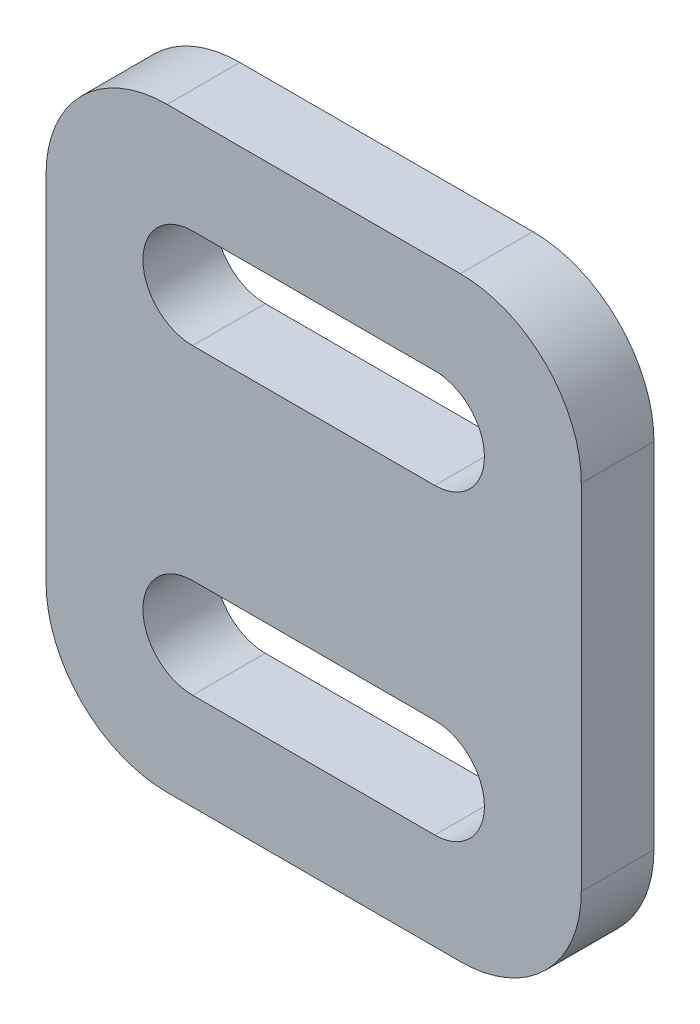
ISO-10303-21;
HEADER;
FILE_DESCRIPTION(('STEP AP214'),'2;1');
FILE_NAME('part.step','',(''),(''),'','','');
FILE_SCHEMA(('AUTOMOTIVE_DESIGN { 1 0 10303 214 1 1 1 1 }'));
ENDSEC;
DATA;
#1=APPLICATION_CONTEXT('core data for automotive mechanical design processes');
#2=APPLICATION_PROTOCOL_DEFINITION('international standard','automotive_design',2000,#1);
#3=PRODUCT_CONTEXT('',#1,'mechanical');
#4=PRODUCT('Part','Part','',(#3));
#5=PRODUCT_RELATED_PRODUCT_CATEGORY('part','',(#4));
#6=PRODUCT_DEFINITION_FORMATION('','',#4);
#7=PRODUCT_DEFINITION_CONTEXT('part definition',#1,'design');
#8=PRODUCT_DEFINITION('design','',#6,#7);
#9=PRODUCT_DEFINITION_SHAPE('','',#8);
#10=(LENGTH_UNIT() NAMED_UNIT(*) SI_UNIT(.MILLI.,.METRE.));
#11=(NAMED_UNIT(*) PLANE_ANGLE_UNIT() SI_UNIT($,.RADIAN.));
#12=(NAMED_UNIT(*) SI_UNIT($,.STERADIAN.) SOLID_ANGLE_UNIT());
#13=UNCERTAINTY_MEASURE_WITH_UNIT(LENGTH_MEASURE(1.E-05),#10,'distance_accuracy_value','');
#14=(GEOMETRIC_REPRESENTATION_CONTEXT(3) GLOBAL_UNCERTAINTY_ASSIGNED_CONTEXT((#13)) GLOBAL_UNIT_ASSIGNED_CONTEXT((#10,
#11,#12)) REPRESENTATION_CONTEXT('',''));
#15=CARTESIAN_POINT('',(0.,0.,0.));
#16=DIRECTION('',(0.,0.,1.));
#17=DIRECTION('',(1.,0.,0.));
#18=AXIS2_PLACEMENT_3D('',#15,#16,#17);
#19=CARTESIAN_POINT('',(16.0718820900679,0.,3.));
#20=DIRECTION('',(-1.,0.,0.));
#21=DIRECTION('',(0.,-1.,0.));
#22=AXIS2_PLACEMENT_3D('',#19,#20,#21);
#23=PLANE('',#22);
#24=DIRECTION('',(0.,1.,0.));
#25=VECTOR('',#24,1.);
#26=CARTESIAN_POINT('',(16.0718820900679,0.,3.));
#27=LINE('',#26,#25);
#28=CARTESIAN_POINT('',(16.0718820900679,12.95,3.));
#29=VERTEX_POINT('',#28);
#30=CARTESIAN_POINT('',(16.0718820900679,27.55,3.));
#31=VERTEX_POINT('',#30);
#32=EDGE_CURVE('E192',#29,#31,#27,.T.);
#33=ORIENTED_EDGE('',*,*,#32,.T.);
#34=DIRECTION('',(0.,0.,-1.));
#35=VECTOR('',#34,1.);
#36=CARTESIAN_POINT('',(16.0718820900679,27.55,0.));
#37=LINE('',#36,#35);
#38=CARTESIAN_POINT('',(16.0718820900679,27.55,0.));
#39=VERTEX_POINT('',#38);
#40=EDGE_CURVE('E248',#31,#39,#37,.T.);
#41=ORIENTED_EDGE('',*,*,#40,.T.);
#42=DIRECTION('',(0.,1.,0.));
#43=VECTOR('',#42,1.);
#44=CARTESIAN_POINT('',(16.0718820900679,0.,0.));
#45=LINE('',#44,#43);
#46=CARTESIAN_POINT('',(16.0718820900679,12.95,0.));
#47=VERTEX_POINT('',#46);
#48=EDGE_CURVE('E225',#47,#39,#45,.T.);
#49=ORIENTED_EDGE('',*,*,#48,.F.);
#50=DIRECTION('',(0.,0.,-1.));
#51=VECTOR('',#50,1.);
#52=CARTESIAN_POINT('',(16.0718820900679,12.95,3.));
#53=LINE('',#52,#51);
#54=EDGE_CURVE('E242',#47,#29,#53,.F.);
#55=ORIENTED_EDGE('',*,*,#54,.T.);
#56=EDGE_LOOP('',(#33,#41,#49,#55));
#57=FACE_BOUND('',#56,.T.);
#58=ADVANCED_FACE('F36',(#57),#23,.T.);
#59=CARTESIAN_POINT('',(0.,7.95,3.));
#60=DIRECTION('',(0.,-1.,0.));
#61=DIRECTION('',(1.,0.,0.));
#62=AXIS2_PLACEMENT_3D('',#59,#60,#61);
#63=PLANE('',#62);
#64=DIRECTION('',(-1.,0.,0.));
#65=VECTOR('',#64,1.);
#66=CARTESIAN_POINT('',(0.,7.95,3.));
#67=LINE('',#66,#65);
#68=CARTESIAN_POINT('',(33.1718820900679,7.94999999999999,3.));
#69=VERTEX_POINT('',#68);
#70=CARTESIAN_POINT('',(21.0718820900679,7.94999999999999,3.));
#71=VERTEX_POINT('',#70);
#72=EDGE_CURVE('E195',#69,#71,#67,.T.);
#73=ORIENTED_EDGE('',*,*,#72,.T.);
#74=DIRECTION('',(0.,0.,-1.));
#75=VECTOR('',#74,1.);
#76=CARTESIAN_POINT('',(21.0718820900679,7.94999999999999,3.));
#77=LINE('',#76,#75);
#78=CARTESIAN_POINT('',(21.0718820900679,7.94999999999999,0.));
#79=VERTEX_POINT('',#78);
#80=EDGE_CURVE('E273',#71,#79,#77,.T.);
#81=ORIENTED_EDGE('',*,*,#80,.T.);
#82=DIRECTION('',(-1.,0.,0.));
#83=VECTOR('',#82,1.);
#84=CARTESIAN_POINT('',(0.,7.95,0.));
#85=LINE('',#84,#83);
#86=CARTESIAN_POINT('',(33.1718820900679,7.94999999999999,0.));
#87=VERTEX_POINT('',#86);
#88=EDGE_CURVE('E228',#87,#79,#85,.T.);
#89=ORIENTED_EDGE('',*,*,#88,.F.);
#90=DIRECTION('',(0.,0.,-1.));
#91=VECTOR('',#90,1.);
#92=CARTESIAN_POINT('',(33.1718820900679,7.94999999999999,3.));
#93=LINE('',#92,#91);
#94=EDGE_CURVE('E271',#87,#69,#93,.F.);
#95=ORIENTED_EDGE('',*,*,#94,.T.);
#96=EDGE_LOOP('',(#73,#81,#89,#95));
#97=FACE_BOUND('',#96,.T.);
#98=ADVANCED_FACE('F278',(#97),#63,.T.);
#99=CARTESIAN_POINT('',(38.1718820900679,0.,3.));
#100=DIRECTION('',(-1.,0.,0.));
#101=DIRECTION('',(0.,0.,1.));
#102=AXIS2_PLACEMENT_3D('',#99,#100,#101);
#103=PLANE('',#102);
#104=DIRECTION('',(0.,1.,0.));
#105=VECTOR('',#104,1.);
#106=CARTESIAN_POINT('',(38.1718820900679,0.,3.));
#107=LINE('',#106,#105);
#108=CARTESIAN_POINT('',(38.1718820900679,12.95,3.));
#109=VERTEX_POINT('',#108);
#110=CARTESIAN_POINT('',(38.1718820900679,27.55,3.));
#111=VERTEX_POINT('',#110);
#112=EDGE_CURVE('E198',#109,#111,#107,.T.);
#113=ORIENTED_EDGE('',*,*,#112,.F.);
#114=DIRECTION('',(0.,0.,-1.));
#115=VECTOR('',#114,1.);
#116=CARTESIAN_POINT('',(38.1718820900679,12.95,0.));
#117=LINE('',#116,#115);
#118=CARTESIAN_POINT('',(38.1718820900679,12.95,0.));
#119=VERTEX_POINT('',#118);
#120=EDGE_CURVE('E11',#109,#119,#117,.T.);
#121=ORIENTED_EDGE('',*,*,#120,.T.);
#122=DIRECTION('',(0.,1.,0.));
#123=VECTOR('',#122,1.);
#124=CARTESIAN_POINT('',(38.1718820900679,0.,0.));
#125=LINE('',#124,#123);
#126=CARTESIAN_POINT('',(38.1718820900679,27.55,0.));
#127=VERTEX_POINT('',#126);
#128=EDGE_CURVE('E231',#119,#127,#125,.T.);
#129=ORIENTED_EDGE('',*,*,#128,.T.);
#130=DIRECTION('',(0.,0.,-1.));
#131=VECTOR('',#130,1.);
#132=CARTESIAN_POINT('',(38.1718820900679,27.55,3.));
#133=LINE('',#132,#131);
#134=EDGE_CURVE('E44',#127,#111,#133,.F.);
#135=ORIENTED_EDGE('',*,*,#134,.T.);
#136=EDGE_LOOP('',(#113,#121,#129,#135));
#137=FACE_BOUND('',#136,.T.);
#138=ADVANCED_FACE('F289',(#137),#103,.F.);
#139=CARTESIAN_POINT('',(32.1218820900679,26.5,3.));
#140=DIRECTION('',(0.,0.,-1.));
#141=DIRECTION('',(-1.,0.,0.));
#142=AXIS2_PLACEMENT_3D('',#139,#140,#141);
#143=CYLINDRICAL_SURFACE('',#142,2.05000000000001);
#144=CARTESIAN_POINT('',(32.1218820900679,26.5,0.));
#145=DIRECTION('',(0.,0.,1.));
#146=DIRECTION('',(1.,0.,0.));
#147=AXIS2_PLACEMENT_3D('',#144,#145,#146);
#148=CIRCLE('',#147,2.05000000000001);
#149=CARTESIAN_POINT('',(32.1218820900679,24.45,0.));
#150=VERTEX_POINT('',#149);
#151=CARTESIAN_POINT('',(32.1218820900679,28.55,0.));
#152=VERTEX_POINT('',#151);
#153=EDGE_CURVE('E213',#150,#152,#148,.T.);
#154=ORIENTED_EDGE('',*,*,#153,.F.);
#155=DIRECTION('',(0.,0.,-1.));
#156=VECTOR('',#155,1.);
#157=CARTESIAN_POINT('',(32.1218820900679,24.45,3.));
#158=LINE('',#157,#156);
#159=CARTESIAN_POINT('',(32.1218820900679,24.45,3.));
#160=VERTEX_POINT('',#159);
#161=EDGE_CURVE('E240',#160,#150,#158,.T.);
#162=ORIENTED_EDGE('',*,*,#161,.F.);
#163=CARTESIAN_POINT('',(32.1218820900679,26.5,3.));
#164=DIRECTION('',(0.,0.,1.));
#165=DIRECTION('',(1.,0.,0.));
#166=AXIS2_PLACEMENT_3D('',#163,#164,#165);
#167=CIRCLE('',#166,2.05000000000001);
#168=CARTESIAN_POINT('',(32.1218820900679,28.55,3.));
#169=VERTEX_POINT('',#168);
#170=EDGE_CURVE('E181',#160,#169,#167,.T.);
#171=ORIENTED_EDGE('',*,*,#170,.T.);
#172=DIRECTION('',(0.,0.,-1.));
#173=VECTOR('',#172,1.);
#174=CARTESIAN_POINT('',(32.1218820900679,28.55,3.));
#175=LINE('',#174,#173);
#176=EDGE_CURVE('E160',#169,#152,#175,.T.);
#177=ORIENTED_EDGE('',*,*,#176,.T.);
#178=EDGE_LOOP('',(#154,#162,#171,#177));
#179=FACE_BOUND('',#178,.T.);
#180=ADVANCED_FACE('F334',(#179),#143,.F.);
#181=CARTESIAN_POINT('',(0.,24.45,3.));
#182=DIRECTION('',(0.,1.,0.));
#183=DIRECTION('',(0.,0.,1.));
#184=AXIS2_PLACEMENT_3D('',#181,#182,#183);
#185=PLANE('',#184);
#186=DIRECTION('',(1.,0.,0.));
#187=VECTOR('',#186,1.);
#188=CARTESIAN_POINT('',(0.,24.45,0.));
#189=LINE('',#188,#187);
#190=CARTESIAN_POINT('',(22.1218820900679,24.45,0.));
#191=VERTEX_POINT('',#190);
#192=EDGE_CURVE('E216',#191,#150,#189,.T.);
#193=ORIENTED_EDGE('',*,*,#192,.F.);
#194=DIRECTION('',(0.,0.,-1.));
#195=VECTOR('',#194,1.);
#196=CARTESIAN_POINT('',(22.1218820900679,24.45,3.));
#197=LINE('',#196,#195);
#198=CARTESIAN_POINT('',(22.1218820900679,24.45,3.));
#199=VERTEX_POINT('',#198);
#200=EDGE_CURVE('E238',#199,#191,#197,.T.);
#201=ORIENTED_EDGE('',*,*,#200,.F.);
#202=DIRECTION('',(1.,0.,0.));
#203=VECTOR('',#202,1.);
#204=CARTESIAN_POINT('',(0.,24.45,3.));
#205=LINE('',#204,#203);
#206=EDGE_CURVE('E184',#199,#160,#205,.T.);
#207=ORIENTED_EDGE('',*,*,#206,.T.);
#208=ORIENTED_EDGE('',*,*,#161,.T.);
#209=EDGE_LOOP('',(#193,#201,#207,#208));
#210=FACE_BOUND('',#209,.T.);
#211=ADVANCED_FACE('F330',(#210),#185,.T.);
#212=CARTESIAN_POINT('',(22.1218820900679,26.5,3.));
#213=DIRECTION('',(0.,0.,-1.));
#214=DIRECTION('',(-1.,0.,0.));
#215=AXIS2_PLACEMENT_3D('',#212,#213,#214);
#216=CYLINDRICAL_SURFACE('',#215,2.05000000000001);
#217=CARTESIAN_POINT('',(22.1218820900679,26.5,0.));
#218=DIRECTION('',(0.,0.,1.));
#219=DIRECTION('',(1.,0.,0.));
#220=AXIS2_PLACEMENT_3D('',#217,#218,#219);
#221=CIRCLE('',#220,2.05000000000001);
#222=CARTESIAN_POINT('',(22.1218820900679,28.55,0.));
#223=VERTEX_POINT('',#222);
#224=EDGE_CURVE('E219',#223,#191,#221,.T.);
#225=ORIENTED_EDGE('',*,*,#224,.F.);
#226=DIRECTION('',(0.,0.,-1.));
#227=VECTOR('',#226,1.);
#228=CARTESIAN_POINT('',(22.1218820900679,28.55,3.));
#229=LINE('',#228,#227);
#230=CARTESIAN_POINT('',(22.1218820900679,28.55,3.));
#231=VERTEX_POINT('',#230);
#232=EDGE_CURVE('E236',#231,#223,#229,.T.);
#233=ORIENTED_EDGE('',*,*,#232,.F.);
#234=CARTESIAN_POINT('',(22.1218820900679,26.5,3.));
#235=DIRECTION('',(0.,0.,1.));
#236=DIRECTION('',(1.,0.,0.));
#237=AXIS2_PLACEMENT_3D('',#234,#235,#236);
#238=CIRCLE('',#237,2.05000000000001);
#239=EDGE_CURVE('E187',#231,#199,#238,.T.);
#240=ORIENTED_EDGE('',*,*,#239,.T.);
#241=ORIENTED_EDGE('',*,*,#200,.T.);
#242=EDGE_LOOP('',(#225,#233,#240,#241));
#243=FACE_BOUND('',#242,.T.);
#244=ADVANCED_FACE('F327',(#243),#216,.F.);
#245=CARTESIAN_POINT('',(32.1218820900679,14.,3.));
#246=DIRECTION('',(0.,0.,-1.));
#247=DIRECTION('',(-1.,0.,0.));
#248=AXIS2_PLACEMENT_3D('',#245,#246,#247);
#249=CYLINDRICAL_SURFACE('',#248,2.05000000000001);
#250=CARTESIAN_POINT('',(32.1218820900679,14.,0.));
#251=DIRECTION('',(0.,0.,1.));
#252=DIRECTION('',(1.,0.,0.));
#253=AXIS2_PLACEMENT_3D('',#250,#251,#252);
#254=CIRCLE('',#253,2.05000000000001);
#255=CARTESIAN_POINT('',(32.1218820900679,11.95,0.));
#256=VERTEX_POINT('',#255);
#257=CARTESIAN_POINT('',(32.1218820900679,16.05,0.));
#258=VERTEX_POINT('',#257);
#259=EDGE_CURVE('E155',#256,#258,#254,.T.);
#260=ORIENTED_EDGE('',*,*,#259,.F.);
#261=DIRECTION('',(0.,0.,-1.));
#262=VECTOR('',#261,1.);
#263=CARTESIAN_POINT('',(32.1218820900679,11.95,3.));
#264=LINE('',#263,#262);
#265=CARTESIAN_POINT('',(32.1218820900679,11.95,3.));
#266=VERTEX_POINT('',#265);
#267=EDGE_CURVE('E150',#266,#256,#264,.T.);
#268=ORIENTED_EDGE('',*,*,#267,.F.);
#269=CARTESIAN_POINT('',(32.1218820900679,14.,3.));
#270=DIRECTION('',(0.,0.,1.));
#271=DIRECTION('',(1.,0.,0.));
#272=AXIS2_PLACEMENT_3D('',#269,#270,#271);
#273=CIRCLE('',#272,2.05000000000001);
#274=CARTESIAN_POINT('',(32.1218820900679,16.05,3.));
#275=VERTEX_POINT('',#274);
#276=EDGE_CURVE('E153',#266,#275,#273,.T.);
#277=ORIENTED_EDGE('',*,*,#276,.T.);
#278=DIRECTION('',(0.,0.,-1.));
#279=VECTOR('',#278,1.);
#280=CARTESIAN_POINT('',(32.1218820900679,16.05,3.));
#281=LINE('',#280,#279);
#282=EDGE_CURVE('E203',#275,#258,#281,.T.);
#283=ORIENTED_EDGE('',*,*,#282,.T.);
#284=EDGE_LOOP('',(#260,#268,#277,#283));
#285=FACE_BOUND('',#284,.T.);
#286=ADVANCED_FACE('F152',(#285),#249,.F.);
#287=CARTESIAN_POINT('',(0.,11.95,3.));
#288=DIRECTION('',(0.,1.,0.));
#289=DIRECTION('',(0.,0.,1.));
#290=AXIS2_PLACEMENT_3D('',#287,#288,#289);
#291=PLANE('',#290);
#292=DIRECTION('',(1.,0.,0.));
#293=VECTOR('',#292,1.);
#294=CARTESIAN_POINT('',(0.,11.95,0.));
#295=LINE('',#294,#293);
#296=CARTESIAN_POINT('',(22.1218820900679,11.95,0.));
#297=VERTEX_POINT('',#296);
#298=EDGE_CURVE('E205',#297,#256,#295,.T.);
#299=ORIENTED_EDGE('',*,*,#298,.F.);
#300=DIRECTION('',(0.,0.,-1.));
#301=VECTOR('',#300,1.);
#302=CARTESIAN_POINT('',(22.1218820900679,11.95,3.));
#303=LINE('',#302,#301);
#304=CARTESIAN_POINT('',(22.1218820900679,11.95,3.));
#305=VERTEX_POINT('',#304);
#306=EDGE_CURVE('E161',#305,#297,#303,.T.);
#307=ORIENTED_EDGE('',*,*,#306,.F.);
#308=DIRECTION('',(1.,0.,0.));
#309=VECTOR('',#308,1.);
#310=CARTESIAN_POINT('',(0.,11.95,3.));
#311=LINE('',#310,#309);
#312=EDGE_CURVE('E168',#305,#266,#311,.T.);
#313=ORIENTED_EDGE('',*,*,#312,.T.);
#314=ORIENTED_EDGE('',*,*,#267,.T.);
#315=EDGE_LOOP('',(#299,#307,#313,#314));
#316=FACE_BOUND('',#315,.T.);
#317=ADVANCED_FACE('F175',(#316),#291,.T.);
#318=CARTESIAN_POINT('',(22.1218820900679,14.,3.));
#319=DIRECTION('',(0.,0.,-1.));
#320=DIRECTION('',(-1.,0.,0.));
#321=AXIS2_PLACEMENT_3D('',#318,#319,#320);
#322=CYLINDRICAL_SURFACE('',#321,2.05000000000001);
#323=CARTESIAN_POINT('',(22.1218820900679,14.,0.));
#324=DIRECTION('',(0.,0.,1.));
#325=DIRECTION('',(1.,0.,0.));
#326=AXIS2_PLACEMENT_3D('',#323,#324,#325);
#327=CIRCLE('',#326,2.05000000000001);
#328=CARTESIAN_POINT('',(22.1218820900679,16.05,0.));
#329=VERTEX_POINT('',#328);
#330=EDGE_CURVE('E207',#329,#297,#327,.T.);
#331=ORIENTED_EDGE('',*,*,#330,.F.);
#332=DIRECTION('',(0.,0.,-1.));
#333=VECTOR('',#332,1.);
#334=CARTESIAN_POINT('',(22.1218820900679,16.05,3.));
#335=LINE('',#334,#333);
#336=CARTESIAN_POINT('',(22.1218820900679,16.05,3.));
#337=VERTEX_POINT('',#336);
#338=EDGE_CURVE('E244',#337,#329,#335,.T.);
#339=ORIENTED_EDGE('',*,*,#338,.F.);
#340=CARTESIAN_POINT('',(22.1218820900679,14.,3.));
#341=DIRECTION('',(0.,0.,1.));
#342=DIRECTION('',(1.,0.,0.));
#343=AXIS2_PLACEMENT_3D('',#340,#341,#342);
#344=CIRCLE('',#343,2.05000000000001);
#345=EDGE_CURVE('E176',#337,#305,#344,.T.);
#346=ORIENTED_EDGE('',*,*,#345,.T.);
#347=ORIENTED_EDGE('',*,*,#306,.T.);
#348=EDGE_LOOP('',(#331,#339,#346,#347));
#349=FACE_BOUND('',#348,.T.);
#350=ADVANCED_FACE('F325',(#349),#322,.F.);
#351=CARTESIAN_POINT('',(0.,28.55,3.));
#352=DIRECTION('',(0.,1.,0.));
#353=DIRECTION('',(0.,0.,1.));
#354=AXIS2_PLACEMENT_3D('',#351,#352,#353);
#355=PLANE('',#354);
#356=DIRECTION('',(1.,0.,0.));
#357=VECTOR('',#356,1.);
#358=CARTESIAN_POINT('',(0.,28.55,0.));
#359=LINE('',#358,#357);
#360=EDGE_CURVE('E222',#223,#152,#359,.T.);
#361=ORIENTED_EDGE('',*,*,#360,.T.);
#362=ORIENTED_EDGE('',*,*,#176,.F.);
#363=DIRECTION('',(1.,0.,0.));
#364=VECTOR('',#363,1.);
#365=CARTESIAN_POINT('',(0.,28.55,3.));
#366=LINE('',#365,#364);
#367=EDGE_CURVE('E190',#231,#169,#366,.T.);
#368=ORIENTED_EDGE('',*,*,#367,.F.);
#369=ORIENTED_EDGE('',*,*,#232,.T.);
#370=EDGE_LOOP('',(#361,#362,#368,#369));
#371=FACE_BOUND('',#370,.T.);
#372=ADVANCED_FACE('F321',(#371),#355,.F.);
#373=CARTESIAN_POINT('',(0.,16.05,3.));
#374=DIRECTION('',(0.,1.,0.));
#375=DIRECTION('',(0.,0.,1.));
#376=AXIS2_PLACEMENT_3D('',#373,#374,#375);
#377=PLANE('',#376);
#378=DIRECTION('',(1.,0.,0.));
#379=VECTOR('',#378,1.);
#380=CARTESIAN_POINT('',(0.,16.05,0.));
#381=LINE('',#380,#379);
#382=EDGE_CURVE('E210',#329,#258,#381,.T.);
#383=ORIENTED_EDGE('',*,*,#382,.T.);
#384=ORIENTED_EDGE('',*,*,#282,.F.);
#385=DIRECTION('',(1.,0.,0.));
#386=VECTOR('',#385,1.);
#387=CARTESIAN_POINT('',(0.,16.05,3.));
#388=LINE('',#387,#386);
#389=EDGE_CURVE('E171',#337,#275,#388,.T.);
#390=ORIENTED_EDGE('',*,*,#389,.F.);
#391=ORIENTED_EDGE('',*,*,#338,.T.);
#392=EDGE_LOOP('',(#383,#384,#390,#391));
#393=FACE_BOUND('',#392,.T.);
#394=ADVANCED_FACE('F324',(#393),#377,.F.);
#395=CARTESIAN_POINT('',(0.,32.55,3.));
#396=DIRECTION('',(0.,-1.,0.));
#397=DIRECTION('',(0.,0.,-1.));
#398=AXIS2_PLACEMENT_3D('',#395,#396,#397);
#399=PLANE('',#398);
#400=DIRECTION('',(-1.,0.,0.));
#401=VECTOR('',#400,1.);
#402=CARTESIAN_POINT('',(0.,32.55,0.));
#403=LINE('',#402,#401);
#404=CARTESIAN_POINT('',(33.1718820900679,32.55,0.));
#405=VERTEX_POINT('',#404);
#406=CARTESIAN_POINT('',(21.0718820900679,32.55,0.));
#407=VERTEX_POINT('',#406);
#408=EDGE_CURVE('E173',#405,#407,#403,.T.);
#409=ORIENTED_EDGE('',*,*,#408,.T.);
#410=DIRECTION('',(0.,0.,-1.));
#411=VECTOR('',#410,1.);
#412=CARTESIAN_POINT('',(21.0718820900679,32.55,3.));
#413=LINE('',#412,#411);
#414=CARTESIAN_POINT('',(21.0718820900679,32.55,3.));
#415=VERTEX_POINT('',#414);
#416=EDGE_CURVE('E262',#407,#415,#413,.F.);
#417=ORIENTED_EDGE('',*,*,#416,.T.);
#418=DIRECTION('',(-1.,0.,0.));
#419=VECTOR('',#418,1.);
#420=CARTESIAN_POINT('',(0.,32.55,3.));
#421=LINE('',#420,#419);
#422=CARTESIAN_POINT('',(33.1718820900679,32.55,3.));
#423=VERTEX_POINT('',#422);
#424=EDGE_CURVE('E200',#423,#415,#421,.T.);
#425=ORIENTED_EDGE('',*,*,#424,.F.);
#426=DIRECTION('',(0.,0.,-1.));
#427=VECTOR('',#426,1.);
#428=CARTESIAN_POINT('',(33.1718820900679,32.55,3.));
#429=LINE('',#428,#427);
#430=EDGE_CURVE('E259',#423,#405,#429,.T.);
#431=ORIENTED_EDGE('',*,*,#430,.T.);
#432=EDGE_LOOP('',(#409,#417,#425,#431));
#433=FACE_BOUND('',#432,.T.);
#434=ADVANCED_FACE('F296',(#433),#399,.F.);
#435=CARTESIAN_POINT('',(0.,0.,3.));
#436=DIRECTION('',(0.,0.,1.));
#437=DIRECTION('',(1.,0.,0.));
#438=AXIS2_PLACEMENT_3D('',#435,#436,#437);
#439=PLANE('',#438);
#440=ORIENTED_EDGE('',*,*,#276,.F.);
#441=ORIENTED_EDGE('',*,*,#312,.F.);
#442=ORIENTED_EDGE('',*,*,#345,.F.);
#443=ORIENTED_EDGE('',*,*,#389,.T.);
#444=EDGE_LOOP('',(#440,#441,#442,#443));
#445=FACE_BOUND('',#444,.T.);
#446=ORIENTED_EDGE('',*,*,#170,.F.);
#447=ORIENTED_EDGE('',*,*,#206,.F.);
#448=ORIENTED_EDGE('',*,*,#239,.F.);
#449=ORIENTED_EDGE('',*,*,#367,.T.);
#450=EDGE_LOOP('',(#446,#447,#448,#449));
#451=FACE_BOUND('',#450,.T.);
#452=ORIENTED_EDGE('',*,*,#424,.T.);
#453=CARTESIAN_POINT('',(21.0718820900679,27.55,3.));
#454=DIRECTION('',(0.,0.,1.));
#455=DIRECTION('',(1.,0.,0.));
#456=AXIS2_PLACEMENT_3D('',#453,#454,#455);
#457=CIRCLE('',#456,5.);
#458=EDGE_CURVE('E269',#415,#31,#457,.T.);
#459=ORIENTED_EDGE('',*,*,#458,.T.);
#460=ORIENTED_EDGE('',*,*,#32,.F.);
#461=CARTESIAN_POINT('',(21.0718820900679,12.95,3.));
#462=DIRECTION('',(0.,0.,1.));
#463=DIRECTION('',(1.,0.,0.));
#464=AXIS2_PLACEMENT_3D('',#461,#462,#463);
#465=CIRCLE('',#464,5.);
#466=EDGE_CURVE('E267',#29,#71,#465,.T.);
#467=ORIENTED_EDGE('',*,*,#466,.T.);
#468=ORIENTED_EDGE('',*,*,#72,.F.);
#469=CARTESIAN_POINT('',(33.1718820900679,12.95,3.));
#470=DIRECTION('',(0.,0.,1.));
#471=DIRECTION('',(1.,0.,0.));
#472=AXIS2_PLACEMENT_3D('',#469,#470,#471);
#473=CIRCLE('',#472,5.);
#474=EDGE_CURVE('E57',#69,#109,#473,.T.);
#475=ORIENTED_EDGE('',*,*,#474,.T.);
#476=ORIENTED_EDGE('',*,*,#112,.T.);
#477=CARTESIAN_POINT('',(33.1718820900679,27.55,3.));
#478=DIRECTION('',(0.,0.,1.));
#479=DIRECTION('',(1.,0.,0.));
#480=AXIS2_PLACEMENT_3D('',#477,#478,#479);
#481=CIRCLE('',#480,5.);
#482=EDGE_CURVE('E264',#111,#423,#481,.T.);
#483=ORIENTED_EDGE('',*,*,#482,.T.);
#484=EDGE_LOOP('',(#452,#459,#460,#467,#468,#475,#476,#483));
#485=FACE_BOUND('',#484,.T.);
#486=ADVANCED_FACE('F165',(#445,#451,#485),#439,.T.);
#487=CARTESIAN_POINT('',(0.,0.,0.));
#488=DIRECTION('',(0.,0.,1.));
#489=DIRECTION('',(1.,0.,0.));
#490=AXIS2_PLACEMENT_3D('',#487,#488,#489);
#491=PLANE('',#490);
#492=ORIENTED_EDGE('',*,*,#259,.T.);
#493=ORIENTED_EDGE('',*,*,#382,.F.);
#494=ORIENTED_EDGE('',*,*,#330,.T.);
#495=ORIENTED_EDGE('',*,*,#298,.T.);
#496=EDGE_LOOP('',(#492,#493,#494,#495));
#497=FACE_BOUND('',#496,.T.);
#498=ORIENTED_EDGE('',*,*,#153,.T.);
#499=ORIENTED_EDGE('',*,*,#360,.F.);
#500=ORIENTED_EDGE('',*,*,#224,.T.);
#501=ORIENTED_EDGE('',*,*,#192,.T.);
#502=EDGE_LOOP('',(#498,#499,#500,#501));
#503=FACE_BOUND('',#502,.T.);
#504=ORIENTED_EDGE('',*,*,#48,.T.);
#505=CARTESIAN_POINT('',(21.0718820900679,27.55,0.));
#506=DIRECTION('',(0.,0.,1.));
#507=DIRECTION('',(1.,0.,0.));
#508=AXIS2_PLACEMENT_3D('',#505,#506,#507);
#509=CIRCLE('',#508,5.);
#510=EDGE_CURVE('E257',#39,#407,#509,.F.);
#511=ORIENTED_EDGE('',*,*,#510,.T.);
#512=ORIENTED_EDGE('',*,*,#408,.F.);
#513=CARTESIAN_POINT('',(33.1718820900679,27.55,0.));
#514=DIRECTION('',(0.,0.,1.));
#515=DIRECTION('',(1.,0.,0.));
#516=AXIS2_PLACEMENT_3D('',#513,#514,#515);
#517=CIRCLE('',#516,5.);
#518=EDGE_CURVE('E251',#405,#127,#517,.F.);
#519=ORIENTED_EDGE('',*,*,#518,.T.);
#520=ORIENTED_EDGE('',*,*,#128,.F.);
#521=CARTESIAN_POINT('',(33.1718820900679,12.95,0.));
#522=DIRECTION('',(0.,0.,1.));
#523=DIRECTION('',(1.,0.,0.));
#524=AXIS2_PLACEMENT_3D('',#521,#522,#523);
#525=CIRCLE('',#524,5.);
#526=EDGE_CURVE('E253',#119,#87,#525,.F.);
#527=ORIENTED_EDGE('',*,*,#526,.T.);
#528=ORIENTED_EDGE('',*,*,#88,.T.);
#529=CARTESIAN_POINT('',(21.0718820900679,12.95,0.));
#530=DIRECTION('',(0.,0.,1.));
#531=DIRECTION('',(1.,0.,0.));
#532=AXIS2_PLACEMENT_3D('',#529,#530,#531);
#533=CIRCLE('',#532,5.);
#534=EDGE_CURVE('E255',#79,#47,#533,.F.);
#535=ORIENTED_EDGE('',*,*,#534,.T.);
#536=EDGE_LOOP('',(#504,#511,#512,#519,#520,#527,#528,#535));
#537=FACE_BOUND('',#536,.T.);
#538=ADVANCED_FACE('F283',(#497,#503,#537),#491,.F.);
#539=CARTESIAN_POINT('',(21.0718820900679,27.55,3.));
#540=DIRECTION('',(0.,0.,1.));
#541=DIRECTION('',(1.,0.,0.));
#542=AXIS2_PLACEMENT_3D('',#539,#540,#541);
#543=CYLINDRICAL_SURFACE('',#542,5.);
#544=ORIENTED_EDGE('',*,*,#458,.F.);
#545=ORIENTED_EDGE('',*,*,#416,.F.);
#546=ORIENTED_EDGE('',*,*,#510,.F.);
#547=ORIENTED_EDGE('',*,*,#40,.F.);
#548=EDGE_LOOP('',(#544,#545,#546,#547));
#549=FACE_BOUND('',#548,.T.);
#550=ADVANCED_FACE('F301',(#549),#543,.T.);
#551=CARTESIAN_POINT('',(21.0718820900679,12.95,3.));
#552=DIRECTION('',(0.,0.,-1.));
#553=DIRECTION('',(-1.,0.,0.));
#554=AXIS2_PLACEMENT_3D('',#551,#552,#553);
#555=CYLINDRICAL_SURFACE('',#554,5.);
#556=ORIENTED_EDGE('',*,*,#466,.F.);
#557=ORIENTED_EDGE('',*,*,#54,.F.);
#558=ORIENTED_EDGE('',*,*,#534,.F.);
#559=ORIENTED_EDGE('',*,*,#80,.F.);
#560=EDGE_LOOP('',(#556,#557,#558,#559));
#561=FACE_BOUND('',#560,.T.);
#562=ADVANCED_FACE('F305',(#561),#555,.T.);
#563=CARTESIAN_POINT('',(33.1718820900679,12.95,3.));
#564=DIRECTION('',(0.,0.,1.));
#565=DIRECTION('',(1.,0.,0.));
#566=AXIS2_PLACEMENT_3D('',#563,#564,#565);
#567=CYLINDRICAL_SURFACE('',#566,5.);
#568=ORIENTED_EDGE('',*,*,#474,.F.);
#569=ORIENTED_EDGE('',*,*,#94,.F.);
#570=ORIENTED_EDGE('',*,*,#526,.F.);
#571=ORIENTED_EDGE('',*,*,#120,.F.);
#572=EDGE_LOOP('',(#568,#569,#570,#571));
#573=FACE_BOUND('',#572,.T.);
#574=ADVANCED_FACE('F288',(#573),#567,.T.);
#575=CARTESIAN_POINT('',(33.1718820900679,27.55,3.));
#576=DIRECTION('',(0.,0.,-1.));
#577=DIRECTION('',(-1.,0.,0.));
#578=AXIS2_PLACEMENT_3D('',#575,#576,#577);
#579=CYLINDRICAL_SURFACE('',#578,5.);
#580=ORIENTED_EDGE('',*,*,#482,.F.);
#581=ORIENTED_EDGE('',*,*,#134,.F.);
#582=ORIENTED_EDGE('',*,*,#518,.F.);
#583=ORIENTED_EDGE('',*,*,#430,.F.);
#584=EDGE_LOOP('',(#580,#581,#582,#583));
#585=FACE_BOUND('',#584,.T.);
#586=ADVANCED_FACE('F38',(#585),#579,.T.);
#587=CLOSED_SHELL('',(#58,#98,#138,#180,#211,#244,#286,#317,#350,#372,#394,#434,#486,#538,#550,
#562,#574,#586));
#588=MANIFOLD_SOLID_BREP('B2',#587);
#589=ADVANCED_BREP_SHAPE_REPRESENTATION('',(#18,#588),#14);
#590=SHAPE_DEFINITION_REPRESENTATION(#9,#589);
ENDSEC;
END-ISO-10303-21;
